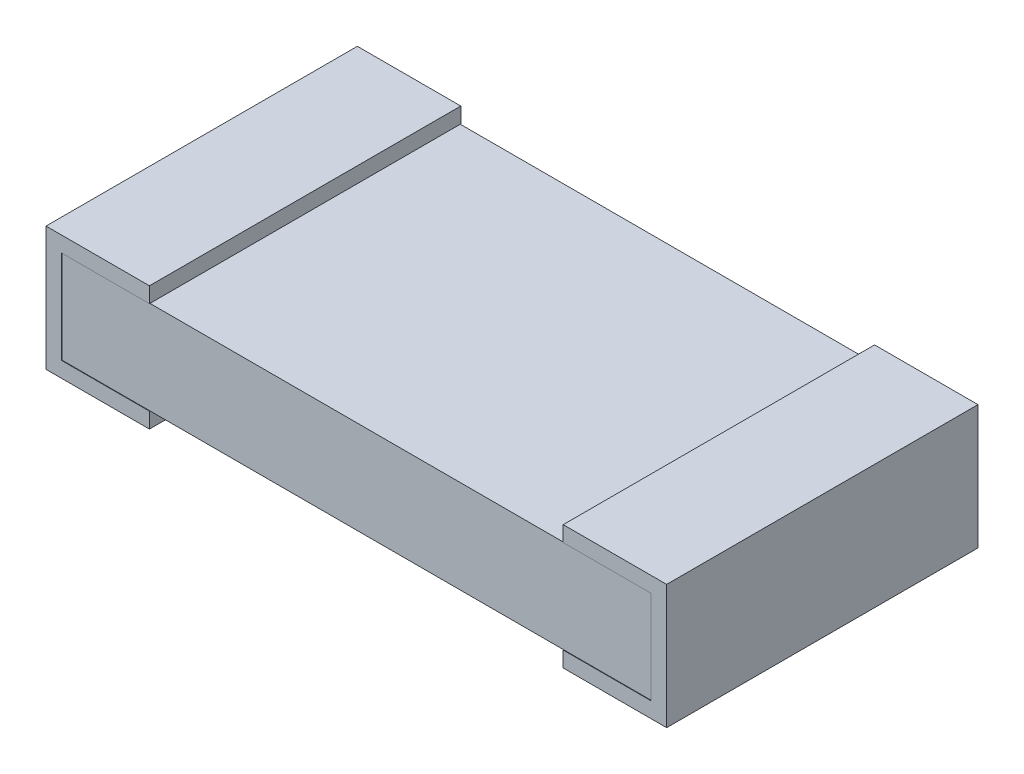
ISO-10303-21;
HEADER;
FILE_DESCRIPTION(('STEP AP214'),'2;1');
FILE_NAME('part.step','',(''),(''),'','','');
FILE_SCHEMA(('AUTOMOTIVE_DESIGN { 1 0 10303 214 1 1 1 1 }'));
ENDSEC;
DATA;
#1=APPLICATION_CONTEXT('core data for automotive mechanical design processes');
#2=APPLICATION_PROTOCOL_DEFINITION('international standard','automotive_design',2000,#1);
#3=PRODUCT_CONTEXT('',#1,'mechanical');
#4=PRODUCT('Part','Part','',(#3));
#5=PRODUCT_RELATED_PRODUCT_CATEGORY('part','',(#4));
#6=PRODUCT_DEFINITION_FORMATION('','',#4);
#7=PRODUCT_DEFINITION_CONTEXT('part definition',#1,'design');
#8=PRODUCT_DEFINITION('design','',#6,#7);
#9=PRODUCT_DEFINITION_SHAPE('','',#8);
#10=(LENGTH_UNIT() NAMED_UNIT(*) SI_UNIT(.MILLI.,.METRE.));
#11=(NAMED_UNIT(*) PLANE_ANGLE_UNIT() SI_UNIT($,.RADIAN.));
#12=(NAMED_UNIT(*) SI_UNIT($,.STERADIAN.) SOLID_ANGLE_UNIT());
#13=UNCERTAINTY_MEASURE_WITH_UNIT(LENGTH_MEASURE(1.E-05),#10,'distance_accuracy_value','');
#14=(GEOMETRIC_REPRESENTATION_CONTEXT(3) GLOBAL_UNCERTAINTY_ASSIGNED_CONTEXT((#13)) GLOBAL_UNIT_ASSIGNED_CONTEXT((#10,
#11,#12)) REPRESENTATION_CONTEXT('',''));
#15=CARTESIAN_POINT('',(0.,0.,0.));
#16=DIRECTION('',(0.,0.,1.));
#17=DIRECTION('',(1.,0.,0.));
#18=AXIS2_PLACEMENT_3D('',#15,#16,#17);
#19=CARTESIAN_POINT('',(2.9718,0.0762000000000004,-0.762));
#20=DIRECTION('',(0.,-1.,0.));
#21=DIRECTION('',(1.,0.,0.));
#22=AXIS2_PLACEMENT_3D('',#19,#20,#21);
#23=PLANE('',#22);
#24=DIRECTION('',(1.,0.,0.));
#25=VECTOR('',#24,1.);
#26=CARTESIAN_POINT('',(2.9718,0.0762000000000004,-0.762));
#27=LINE('',#26,#25);
#28=CARTESIAN_POINT('',(0.508,0.0762000000000001,-0.762));
#29=VERTEX_POINT('',#28);
#30=CARTESIAN_POINT('',(2.54,0.0762000000000001,-0.762));
#31=VERTEX_POINT('',#30);
#32=EDGE_CURVE('E43',#29,#31,#27,.T.);
#33=ORIENTED_EDGE('',*,*,#32,.T.);
#34=DIRECTION('',(0.,0.,-1.));
#35=VECTOR('',#34,1.);
#36=CARTESIAN_POINT('',(2.54,0.0762000000000001,0.76454));
#37=LINE('',#36,#35);
#38=CARTESIAN_POINT('',(2.54,0.0762000000000001,0.762));
#39=VERTEX_POINT('',#38);
#40=EDGE_CURVE('E274',#39,#31,#37,.T.);
#41=ORIENTED_EDGE('',*,*,#40,.F.);
#42=DIRECTION('',(1.,0.,0.));
#43=VECTOR('',#42,1.);
#44=CARTESIAN_POINT('',(2.9718,0.0762000000000004,0.762));
#45=LINE('',#44,#43);
#46=CARTESIAN_POINT('',(0.508,0.0762000000000001,0.762));
#47=VERTEX_POINT('',#46);
#48=EDGE_CURVE('E373',#47,#39,#45,.T.);
#49=ORIENTED_EDGE('',*,*,#48,.F.);
#50=DIRECTION('',(0.,0.,-1.));
#51=VECTOR('',#50,1.);
#52=CARTESIAN_POINT('',(0.508,0.0762000000000001,0.76454));
#53=LINE('',#52,#51);
#54=EDGE_CURVE('E335',#47,#29,#53,.T.);
#55=ORIENTED_EDGE('',*,*,#54,.T.);
#56=EDGE_LOOP('',(#33,#41,#49,#55));
#57=FACE_BOUND('',#56,.T.);
#58=ADVANCED_FACE('F34',(#57),#23,.T.);
#59=CARTESIAN_POINT('',(0.0762,0.5334,-0.762));
#60=DIRECTION('',(0.,1.,0.));
#61=DIRECTION('',(0.,0.,1.));
#62=AXIS2_PLACEMENT_3D('',#59,#60,#61);
#63=PLANE('',#62);
#64=DIRECTION('',(-1.,0.,0.));
#65=VECTOR('',#64,1.);
#66=CARTESIAN_POINT('',(0.0762,0.5334,0.762));
#67=LINE('',#66,#65);
#68=CARTESIAN_POINT('',(2.54,0.5334,0.762));
#69=VERTEX_POINT('',#68);
#70=CARTESIAN_POINT('',(0.508,0.5334,0.762));
#71=VERTEX_POINT('',#70);
#72=EDGE_CURVE('E366',#69,#71,#67,.T.);
#73=ORIENTED_EDGE('',*,*,#72,.F.);
#74=DIRECTION('',(0.,0.,-1.));
#75=VECTOR('',#74,1.);
#76=CARTESIAN_POINT('',(2.54,0.5334,0.76454));
#77=LINE('',#76,#75);
#78=CARTESIAN_POINT('',(2.54,0.5334,-0.762));
#79=VERTEX_POINT('',#78);
#80=EDGE_CURVE('E263',#69,#79,#77,.T.);
#81=ORIENTED_EDGE('',*,*,#80,.T.);
#82=DIRECTION('',(-1.,0.,0.));
#83=VECTOR('',#82,1.);
#84=CARTESIAN_POINT('',(0.0762,0.5334,-0.762));
#85=LINE('',#84,#83);
#86=CARTESIAN_POINT('',(0.508,0.5334,-0.762));
#87=VERTEX_POINT('',#86);
#88=EDGE_CURVE('E355',#79,#87,#85,.T.);
#89=ORIENTED_EDGE('',*,*,#88,.T.);
#90=DIRECTION('',(0.,0.,-1.));
#91=VECTOR('',#90,1.);
#92=CARTESIAN_POINT('',(0.508,0.5334,0.76454));
#93=LINE('',#92,#91);
#94=EDGE_CURVE('E346',#71,#87,#93,.T.);
#95=ORIENTED_EDGE('',*,*,#94,.F.);
#96=EDGE_LOOP('',(#73,#81,#89,#95));
#97=FACE_BOUND('',#96,.T.);
#98=ADVANCED_FACE('F36',(#97),#63,.T.);
#99=CARTESIAN_POINT('',(2.9718,0.5334,-0.762));
#100=DIRECTION('',(0.,0.,-1.));
#101=DIRECTION('',(-1.,0.,0.));
#102=AXIS2_PLACEMENT_3D('',#99,#100,#101);
#103=PLANE('',#102);
#104=DIRECTION('',(0.,1.,0.));
#105=VECTOR('',#104,1.);
#106=CARTESIAN_POINT('',(2.9718,0.0762000000000004,-0.762));
#107=LINE('',#106,#105);
#108=CARTESIAN_POINT('',(2.9718,0.0762,-0.762));
#109=VERTEX_POINT('',#108);
#110=CARTESIAN_POINT('',(2.9718,0.5334,-0.762));
#111=VERTEX_POINT('',#110);
#112=EDGE_CURVE('E353',#109,#111,#107,.T.);
#113=ORIENTED_EDGE('',*,*,#112,.F.);
#114=DIRECTION('',(-1.,0.,0.));
#115=VECTOR('',#114,1.);
#116=CARTESIAN_POINT('',(2.9718,0.0762,-0.762));
#117=LINE('',#116,#115);
#118=EDGE_CURVE('E256',#109,#31,#117,.T.);
#119=ORIENTED_EDGE('',*,*,#118,.T.);
#120=ORIENTED_EDGE('',*,*,#32,.F.);
#121=CARTESIAN_POINT('',(0.0762,0.0762,-0.762));
#122=VERTEX_POINT('',#121);
#123=EDGE_CURVE('E11',#122,#29,#27,.T.);
#124=ORIENTED_EDGE('',*,*,#123,.F.);
#125=DIRECTION('',(0.,-1.,0.));
#126=VECTOR('',#125,1.);
#127=CARTESIAN_POINT('',(0.0762,0.5334,-0.762));
#128=LINE('',#127,#126);
#129=CARTESIAN_POINT('',(0.0762,0.5334,-0.762));
#130=VERTEX_POINT('',#129);
#131=EDGE_CURVE('E358',#130,#122,#128,.T.);
#132=ORIENTED_EDGE('',*,*,#131,.F.);
#133=DIRECTION('',(-1.,0.,0.));
#134=VECTOR('',#133,1.);
#135=CARTESIAN_POINT('',(2.9718,0.5334,-0.762));
#136=LINE('',#135,#134);
#137=EDGE_CURVE('E329',#87,#130,#136,.T.);
#138=ORIENTED_EDGE('',*,*,#137,.F.);
#139=ORIENTED_EDGE('',*,*,#88,.F.);
#140=EDGE_CURVE('E356',#111,#79,#85,.T.);
#141=ORIENTED_EDGE('',*,*,#140,.F.);
#142=EDGE_LOOP('',(#113,#119,#120,#124,#132,#138,#139,#141));
#143=FACE_BOUND('',#142,.T.);
#144=ADVANCED_FACE('F437',(#143),#103,.T.);
#145=CARTESIAN_POINT('',(2.9718,0.5334,0.762));
#146=DIRECTION('',(0.,0.,-1.));
#147=DIRECTION('',(-1.,0.,0.));
#148=AXIS2_PLACEMENT_3D('',#145,#146,#147);
#149=PLANE('',#148);
#150=DIRECTION('',(0.,1.,0.));
#151=VECTOR('',#150,1.);
#152=CARTESIAN_POINT('',(2.9718,0.0762000000000004,0.762));
#153=LINE('',#152,#151);
#154=CARTESIAN_POINT('',(2.9718,0.0762000000000004,0.762));
#155=VERTEX_POINT('',#154);
#156=CARTESIAN_POINT('',(2.9718,0.5334,0.762));
#157=VERTEX_POINT('',#156);
#158=EDGE_CURVE('E352',#155,#157,#153,.T.);
#159=ORIENTED_EDGE('',*,*,#158,.T.);
#160=EDGE_CURVE('E363',#157,#69,#67,.T.);
#161=ORIENTED_EDGE('',*,*,#160,.T.);
#162=ORIENTED_EDGE('',*,*,#72,.T.);
#163=CARTESIAN_POINT('',(0.0762,0.5334,0.762));
#164=VERTEX_POINT('',#163);
#165=EDGE_CURVE('E362',#71,#164,#67,.T.);
#166=ORIENTED_EDGE('',*,*,#165,.T.);
#167=DIRECTION('',(0.,-1.,0.));
#168=VECTOR('',#167,1.);
#169=CARTESIAN_POINT('',(0.0762,0.5334,0.762));
#170=LINE('',#169,#168);
#171=CARTESIAN_POINT('',(0.0762,0.0762,0.762));
#172=VERTEX_POINT('',#171);
#173=EDGE_CURVE('E365',#164,#172,#170,.T.);
#174=ORIENTED_EDGE('',*,*,#173,.T.);
#175=EDGE_CURVE('E38',#172,#47,#45,.T.);
#176=ORIENTED_EDGE('',*,*,#175,.T.);
#177=ORIENTED_EDGE('',*,*,#48,.T.);
#178=EDGE_CURVE('E368',#39,#155,#45,.T.);
#179=ORIENTED_EDGE('',*,*,#178,.T.);
#180=EDGE_LOOP('',(#159,#161,#162,#166,#174,#176,#177,#179));
#181=FACE_BOUND('',#180,.T.);
#182=ADVANCED_FACE('F375',(#181),#149,.F.);
#183=CARTESIAN_POINT('',(0.0762,0.0762,0.76454));
#184=DIRECTION('',(0.,1.,0.));
#185=DIRECTION('',(-1.,0.,0.));
#186=AXIS2_PLACEMENT_3D('',#183,#184,#185);
#187=PLANE('',#186);
#188=ORIENTED_EDGE('',*,*,#175,.F.);
#189=DIRECTION('',(0.,0.,-1.));
#190=VECTOR('',#189,1.);
#191=CARTESIAN_POINT('',(0.0762,0.0762,0.76454));
#192=LINE('',#191,#190);
#193=CARTESIAN_POINT('',(0.0762,0.0762,0.76454));
#194=VERTEX_POINT('',#193);
#195=EDGE_CURVE('E337',#194,#172,#192,.T.);
#196=ORIENTED_EDGE('',*,*,#195,.F.);
#197=DIRECTION('',(1.,0.,0.));
#198=VECTOR('',#197,1.);
#199=CARTESIAN_POINT('',(0.0762,0.0762,0.76454));
#200=LINE('',#199,#198);
#201=CARTESIAN_POINT('',(0.508,0.0762000000000001,0.76454));
#202=VERTEX_POINT('',#201);
#203=EDGE_CURVE('E295',#194,#202,#200,.T.);
#204=ORIENTED_EDGE('',*,*,#203,.T.);
#205=EDGE_CURVE('E332',#202,#47,#53,.T.);
#206=ORIENTED_EDGE('',*,*,#205,.T.);
#207=EDGE_LOOP('',(#188,#196,#204,#206));
#208=FACE_BOUND('',#207,.T.);
#209=ADVANCED_FACE('F378',(#208),#187,.T.);
#210=CARTESIAN_POINT('',(0.0762,0.5334,0.76454));
#211=DIRECTION('',(1.,0.,0.));
#212=DIRECTION('',(0.,0.,-1.));
#213=AXIS2_PLACEMENT_3D('',#210,#211,#212);
#214=PLANE('',#213);
#215=ORIENTED_EDGE('',*,*,#173,.F.);
#216=DIRECTION('',(0.,0.,-1.));
#217=VECTOR('',#216,1.);
#218=CARTESIAN_POINT('',(0.0762,0.5334,0.76454));
#219=LINE('',#218,#217);
#220=CARTESIAN_POINT('',(0.0762,0.5334,0.76454));
#221=VERTEX_POINT('',#220);
#222=EDGE_CURVE('E59',#221,#164,#219,.T.);
#223=ORIENTED_EDGE('',*,*,#222,.F.);
#224=DIRECTION('',(0.,-1.,0.));
#225=VECTOR('',#224,1.);
#226=CARTESIAN_POINT('',(0.0762,0.5334,0.76454));
#227=LINE('',#226,#225);
#228=EDGE_CURVE('E292',#221,#194,#227,.T.);
#229=ORIENTED_EDGE('',*,*,#228,.T.);
#230=ORIENTED_EDGE('',*,*,#195,.T.);
#231=EDGE_LOOP('',(#215,#223,#229,#230));
#232=FACE_BOUND('',#231,.T.);
#233=ADVANCED_FACE('F381',(#232),#214,.T.);
#234=CARTESIAN_POINT('',(0.508,0.5334,0.76454));
#235=DIRECTION('',(0.,-1.,0.));
#236=DIRECTION('',(0.,0.,-1.));
#237=AXIS2_PLACEMENT_3D('',#234,#235,#236);
#238=PLANE('',#237);
#239=ORIENTED_EDGE('',*,*,#165,.F.);
#240=CARTESIAN_POINT('',(0.508,0.5334,0.76454));
#241=VERTEX_POINT('',#240);
#242=EDGE_CURVE('E343',#241,#71,#93,.T.);
#243=ORIENTED_EDGE('',*,*,#242,.F.);
#244=DIRECTION('',(-1.,0.,0.));
#245=VECTOR('',#244,1.);
#246=CARTESIAN_POINT('',(0.508,0.5334,0.76454));
#247=LINE('',#246,#245);
#248=EDGE_CURVE('E290',#241,#221,#247,.T.);
#249=ORIENTED_EDGE('',*,*,#248,.T.);
#250=ORIENTED_EDGE('',*,*,#222,.T.);
#251=EDGE_LOOP('',(#239,#243,#249,#250));
#252=FACE_BOUND('',#251,.T.);
#253=ADVANCED_FACE('F389',(#252),#238,.T.);
#254=CARTESIAN_POINT('',(0.,0.,0.76454));
#255=DIRECTION('',(-1.,0.,0.));
#256=DIRECTION('',(0.,0.,1.));
#257=AXIS2_PLACEMENT_3D('',#254,#255,#256);
#258=PLANE('',#257);
#259=DIRECTION('',(0.,1.,0.));
#260=VECTOR('',#259,1.);
#261=CARTESIAN_POINT('',(0.,0.,-0.76454));
#262=LINE('',#261,#260);
#263=CARTESIAN_POINT('',(0.,0.,-0.76454));
#264=VERTEX_POINT('',#263);
#265=CARTESIAN_POINT('',(0.,0.6096,-0.76454));
#266=VERTEX_POINT('',#265);
#267=EDGE_CURVE('E279',#264,#266,#262,.T.);
#268=ORIENTED_EDGE('',*,*,#267,.F.);
#269=DIRECTION('',(0.,0.,-1.));
#270=VECTOR('',#269,1.);
#271=CARTESIAN_POINT('',(0.,0.,0.76454));
#272=LINE('',#271,#270);
#273=CARTESIAN_POINT('',(0.,0.,0.76454));
#274=VERTEX_POINT('',#273);
#275=EDGE_CURVE('E327',#274,#264,#272,.T.);
#276=ORIENTED_EDGE('',*,*,#275,.F.);
#277=DIRECTION('',(0.,1.,0.));
#278=VECTOR('',#277,1.);
#279=CARTESIAN_POINT('',(0.,0.,0.76454));
#280=LINE('',#279,#278);
#281=CARTESIAN_POINT('',(0.,0.6096,0.76454));
#282=VERTEX_POINT('',#281);
#283=EDGE_CURVE('E280',#274,#282,#280,.T.);
#284=ORIENTED_EDGE('',*,*,#283,.T.);
#285=DIRECTION('',(0.,0.,-1.));
#286=VECTOR('',#285,1.);
#287=CARTESIAN_POINT('',(0.,0.6096,0.76454));
#288=LINE('',#287,#286);
#289=EDGE_CURVE('E304',#282,#266,#288,.T.);
#290=ORIENTED_EDGE('',*,*,#289,.T.);
#291=EDGE_LOOP('',(#268,#276,#284,#290));
#292=FACE_BOUND('',#291,.T.);
#293=ADVANCED_FACE('F415',(#292),#258,.T.);
#294=CARTESIAN_POINT('',(0.,0.,0.76454));
#295=DIRECTION('',(0.,-1.,0.));
#296=DIRECTION('',(1.,0.,0.));
#297=AXIS2_PLACEMENT_3D('',#294,#295,#296);
#298=PLANE('',#297);
#299=DIRECTION('',(-1.,0.,0.));
#300=VECTOR('',#299,1.);
#301=CARTESIAN_POINT('',(0.,0.,-0.76454));
#302=LINE('',#301,#300);
#303=CARTESIAN_POINT('',(0.508,0.,-0.76454));
#304=VERTEX_POINT('',#303);
#305=EDGE_CURVE('E284',#304,#264,#302,.T.);
#306=ORIENTED_EDGE('',*,*,#305,.F.);
#307=DIRECTION('',(0.,0.,-1.));
#308=VECTOR('',#307,1.);
#309=CARTESIAN_POINT('',(0.508,0.,0.76454));
#310=LINE('',#309,#308);
#311=CARTESIAN_POINT('',(0.508,0.,0.76454));
#312=VERTEX_POINT('',#311);
#313=EDGE_CURVE('E330',#312,#304,#310,.T.);
#314=ORIENTED_EDGE('',*,*,#313,.F.);
#315=DIRECTION('',(-1.,0.,0.));
#316=VECTOR('',#315,1.);
#317=CARTESIAN_POINT('',(0.,0.,0.76454));
#318=LINE('',#317,#316);
#319=EDGE_CURVE('E301',#312,#274,#318,.T.);
#320=ORIENTED_EDGE('',*,*,#319,.T.);
#321=ORIENTED_EDGE('',*,*,#275,.T.);
#322=EDGE_LOOP('',(#306,#314,#320,#321));
#323=FACE_BOUND('',#322,.T.);
#324=ADVANCED_FACE('F418',(#323),#298,.T.);
#325=CARTESIAN_POINT('',(0.508,0.,0.76454));
#326=DIRECTION('',(1.,0.,0.));
#327=DIRECTION('',(0.,0.,-1.));
#328=AXIS2_PLACEMENT_3D('',#325,#326,#327);
#329=PLANE('',#328);
#330=DIRECTION('',(0.,-1.,0.));
#331=VECTOR('',#330,1.);
#332=CARTESIAN_POINT('',(0.508,0.,-0.76454));
#333=LINE('',#332,#331);
#334=CARTESIAN_POINT('',(0.508,0.0762000000000001,-0.76454));
#335=VERTEX_POINT('',#334);
#336=EDGE_CURVE('E322',#335,#304,#333,.T.);
#337=ORIENTED_EDGE('',*,*,#336,.F.);
#338=EDGE_CURVE('E336',#29,#335,#53,.T.);
#339=ORIENTED_EDGE('',*,*,#338,.F.);
#340=ORIENTED_EDGE('',*,*,#54,.F.);
#341=ORIENTED_EDGE('',*,*,#205,.F.);
#342=DIRECTION('',(0.,-1.,0.));
#343=VECTOR('',#342,1.);
#344=CARTESIAN_POINT('',(0.508,0.,0.76454));
#345=LINE('',#344,#343);
#346=EDGE_CURVE('E298',#202,#312,#345,.T.);
#347=ORIENTED_EDGE('',*,*,#346,.T.);
#348=ORIENTED_EDGE('',*,*,#313,.T.);
#349=EDGE_LOOP('',(#337,#339,#340,#341,#347,#348));
#350=FACE_BOUND('',#349,.T.);
#351=ADVANCED_FACE('F421',(#350),#329,.T.);
#352=CARTESIAN_POINT('',(0.0762,0.0762,-0.76454));
#353=VERTEX_POINT('',#352);
#354=EDGE_CURVE('E340',#122,#353,#192,.T.);
#355=ORIENTED_EDGE('',*,*,#354,.F.);
#356=ORIENTED_EDGE('',*,*,#123,.T.);
#357=ORIENTED_EDGE('',*,*,#338,.T.);
#358=DIRECTION('',(1.,0.,0.));
#359=VECTOR('',#358,1.);
#360=CARTESIAN_POINT('',(0.0762,0.0762,-0.76454));
#361=LINE('',#360,#359);
#362=EDGE_CURVE('E319',#353,#335,#361,.T.);
#363=ORIENTED_EDGE('',*,*,#362,.F.);
#364=EDGE_LOOP('',(#355,#356,#357,#363));
#365=FACE_BOUND('',#364,.T.);
#366=ADVANCED_FACE('F430',(#365),#187,.T.);
#367=CARTESIAN_POINT('',(0.0762,0.5334,-0.76454));
#368=VERTEX_POINT('',#367);
#369=EDGE_CURVE('E342',#130,#368,#219,.T.);
#370=ORIENTED_EDGE('',*,*,#369,.F.);
#371=ORIENTED_EDGE('',*,*,#131,.T.);
#372=ORIENTED_EDGE('',*,*,#354,.T.);
#373=DIRECTION('',(0.,-1.,0.));
#374=VECTOR('',#373,1.);
#375=CARTESIAN_POINT('',(0.0762,0.5334,-0.76454));
#376=LINE('',#375,#374);
#377=EDGE_CURVE('E316',#368,#353,#376,.T.);
#378=ORIENTED_EDGE('',*,*,#377,.F.);
#379=EDGE_LOOP('',(#370,#371,#372,#378));
#380=FACE_BOUND('',#379,.T.);
#381=ADVANCED_FACE('F433',(#380),#214,.T.);
#382=CARTESIAN_POINT('',(0.508,0.5334,-0.76454));
#383=VERTEX_POINT('',#382);
#384=EDGE_CURVE('E347',#87,#383,#93,.T.);
#385=ORIENTED_EDGE('',*,*,#384,.F.);
#386=ORIENTED_EDGE('',*,*,#137,.T.);
#387=ORIENTED_EDGE('',*,*,#369,.T.);
#388=DIRECTION('',(-1.,0.,0.));
#389=VECTOR('',#388,1.);
#390=CARTESIAN_POINT('',(0.508,0.5334,-0.76454));
#391=LINE('',#390,#389);
#392=EDGE_CURVE('E313',#383,#368,#391,.T.);
#393=ORIENTED_EDGE('',*,*,#392,.F.);
#394=EDGE_LOOP('',(#385,#386,#387,#393));
#395=FACE_BOUND('',#394,.T.);
#396=ADVANCED_FACE('F403',(#395),#238,.T.);
#397=CARTESIAN_POINT('',(0.508,0.6096,0.76454));
#398=DIRECTION('',(1.,0.,0.));
#399=DIRECTION('',(0.,1.,0.));
#400=AXIS2_PLACEMENT_3D('',#397,#398,#399);
#401=PLANE('',#400);
#402=DIRECTION('',(0.,-1.,0.));
#403=VECTOR('',#402,1.);
#404=CARTESIAN_POINT('',(0.508,0.6096,-0.76454));
#405=LINE('',#404,#403);
#406=CARTESIAN_POINT('',(0.508,0.6096,-0.76454));
#407=VERTEX_POINT('',#406);
#408=EDGE_CURVE('E310',#407,#383,#405,.T.);
#409=ORIENTED_EDGE('',*,*,#408,.F.);
#410=DIRECTION('',(0.,0.,-1.));
#411=VECTOR('',#410,1.);
#412=CARTESIAN_POINT('',(0.508,0.6096,0.76454));
#413=LINE('',#412,#411);
#414=CARTESIAN_POINT('',(0.508,0.6096,0.76454));
#415=VERTEX_POINT('',#414);
#416=EDGE_CURVE('E348',#415,#407,#413,.T.);
#417=ORIENTED_EDGE('',*,*,#416,.F.);
#418=DIRECTION('',(0.,-1.,0.));
#419=VECTOR('',#418,1.);
#420=CARTESIAN_POINT('',(0.508,0.6096,0.76454));
#421=LINE('',#420,#419);
#422=EDGE_CURVE('E287',#415,#241,#421,.T.);
#423=ORIENTED_EDGE('',*,*,#422,.T.);
#424=ORIENTED_EDGE('',*,*,#242,.T.);
#425=ORIENTED_EDGE('',*,*,#94,.T.);
#426=ORIENTED_EDGE('',*,*,#384,.T.);
#427=EDGE_LOOP('',(#409,#417,#423,#424,#425,#426));
#428=FACE_BOUND('',#427,.T.);
#429=ADVANCED_FACE('F394',(#428),#401,.T.);
#430=CARTESIAN_POINT('',(0.,0.6096,0.76454));
#431=DIRECTION('',(0.,1.,0.));
#432=DIRECTION('',(0.,0.,1.));
#433=AXIS2_PLACEMENT_3D('',#430,#431,#432);
#434=PLANE('',#433);
#435=DIRECTION('',(1.,0.,0.));
#436=VECTOR('',#435,1.);
#437=CARTESIAN_POINT('',(0.,0.6096,-0.76454));
#438=LINE('',#437,#436);
#439=EDGE_CURVE('E307',#266,#407,#438,.T.);
#440=ORIENTED_EDGE('',*,*,#439,.F.);
#441=ORIENTED_EDGE('',*,*,#289,.F.);
#442=DIRECTION('',(1.,0.,0.));
#443=VECTOR('',#442,1.);
#444=CARTESIAN_POINT('',(0.,0.6096,0.76454));
#445=LINE('',#444,#443);
#446=EDGE_CURVE('E283',#282,#415,#445,.T.);
#447=ORIENTED_EDGE('',*,*,#446,.T.);
#448=ORIENTED_EDGE('',*,*,#416,.T.);
#449=EDGE_LOOP('',(#440,#441,#447,#448));
#450=FACE_BOUND('',#449,.T.);
#451=ADVANCED_FACE('F411',(#450),#434,.T.);
#452=CARTESIAN_POINT('',(0.,0.6096,0.76454));
#453=DIRECTION('',(0.,0.,-1.));
#454=DIRECTION('',(-1.,0.,0.));
#455=AXIS2_PLACEMENT_3D('',#452,#453,#454);
#456=PLANE('',#455);
#457=ORIENTED_EDGE('',*,*,#283,.F.);
#458=ORIENTED_EDGE('',*,*,#319,.F.);
#459=ORIENTED_EDGE('',*,*,#346,.F.);
#460=ORIENTED_EDGE('',*,*,#203,.F.);
#461=ORIENTED_EDGE('',*,*,#228,.F.);
#462=ORIENTED_EDGE('',*,*,#248,.F.);
#463=ORIENTED_EDGE('',*,*,#422,.F.);
#464=ORIENTED_EDGE('',*,*,#446,.F.);
#465=EDGE_LOOP('',(#457,#458,#459,#460,#461,#462,#463,#464));
#466=FACE_BOUND('',#465,.T.);
#467=ADVANCED_FACE('F386',(#466),#456,.F.);
#468=CARTESIAN_POINT('',(0.,0.6096,-0.76454));
#469=DIRECTION('',(0.,0.,-1.));
#470=DIRECTION('',(-1.,0.,0.));
#471=AXIS2_PLACEMENT_3D('',#468,#469,#470);
#472=PLANE('',#471);
#473=ORIENTED_EDGE('',*,*,#267,.T.);
#474=ORIENTED_EDGE('',*,*,#439,.T.);
#475=ORIENTED_EDGE('',*,*,#408,.T.);
#476=ORIENTED_EDGE('',*,*,#392,.T.);
#477=ORIENTED_EDGE('',*,*,#377,.T.);
#478=ORIENTED_EDGE('',*,*,#362,.T.);
#479=ORIENTED_EDGE('',*,*,#336,.T.);
#480=ORIENTED_EDGE('',*,*,#305,.T.);
#481=EDGE_LOOP('',(#473,#474,#475,#476,#477,#478,#479,#480));
#482=FACE_BOUND('',#481,.T.);
#483=ADVANCED_FACE('F407',(#482),#472,.T.);
#484=CARTESIAN_POINT('',(2.54,0.5334,0.76454));
#485=DIRECTION('',(0.,1.,0.));
#486=DIRECTION('',(0.,0.,1.));
#487=AXIS2_PLACEMENT_3D('',#484,#485,#486);
#488=PLANE('',#487);
#489=CARTESIAN_POINT('',(2.54,0.5334,0.76454));
#490=VERTEX_POINT('',#489);
#491=EDGE_CURVE('E260',#490,#69,#77,.T.);
#492=ORIENTED_EDGE('',*,*,#491,.T.);
#493=ORIENTED_EDGE('',*,*,#160,.F.);
#494=DIRECTION('',(0.,0.,-1.));
#495=VECTOR('',#494,1.);
#496=CARTESIAN_POINT('',(2.9718,0.5334,0.76454));
#497=LINE('',#496,#495);
#498=CARTESIAN_POINT('',(2.9718,0.5334,0.76454));
#499=VERTEX_POINT('',#498);
#500=EDGE_CURVE('E265',#499,#157,#497,.T.);
#501=ORIENTED_EDGE('',*,*,#500,.F.);
#502=DIRECTION('',(1.,0.,0.));
#503=VECTOR('',#502,1.);
#504=CARTESIAN_POINT('',(2.54,0.5334,0.76454));
#505=LINE('',#504,#503);
#506=EDGE_CURVE('E234',#490,#499,#505,.T.);
#507=ORIENTED_EDGE('',*,*,#506,.F.);
#508=EDGE_LOOP('',(#492,#493,#501,#507));
#509=FACE_BOUND('',#508,.T.);
#510=ADVANCED_FACE('F463',(#509),#488,.F.);
#511=CARTESIAN_POINT('',(2.9718,0.5334,0.76454));
#512=DIRECTION('',(1.,0.,0.));
#513=DIRECTION('',(0.,0.,-1.));
#514=AXIS2_PLACEMENT_3D('',#511,#512,#513);
#515=PLANE('',#514);
#516=ORIENTED_EDGE('',*,*,#500,.T.);
#517=ORIENTED_EDGE('',*,*,#158,.F.);
#518=DIRECTION('',(0.,0.,-1.));
#519=VECTOR('',#518,1.);
#520=CARTESIAN_POINT('',(2.9718,0.0762,0.76454));
#521=LINE('',#520,#519);
#522=CARTESIAN_POINT('',(2.9718,0.0762,0.76454));
#523=VERTEX_POINT('',#522);
#524=EDGE_CURVE('E51',#523,#155,#521,.T.);
#525=ORIENTED_EDGE('',*,*,#524,.F.);
#526=DIRECTION('',(0.,-1.,0.));
#527=VECTOR('',#526,1.);
#528=CARTESIAN_POINT('',(2.9718,0.5334,0.76454));
#529=LINE('',#528,#527);
#530=EDGE_CURVE('E232',#499,#523,#529,.T.);
#531=ORIENTED_EDGE('',*,*,#530,.F.);
#532=EDGE_LOOP('',(#516,#517,#525,#531));
#533=FACE_BOUND('',#532,.T.);
#534=ADVANCED_FACE('F466',(#533),#515,.F.);
#535=CARTESIAN_POINT('',(2.9718,0.0762,0.76454));
#536=DIRECTION('',(0.,-1.,0.));
#537=DIRECTION('',(1.,0.,0.));
#538=AXIS2_PLACEMENT_3D('',#535,#536,#537);
#539=PLANE('',#538);
#540=ORIENTED_EDGE('',*,*,#524,.T.);
#541=ORIENTED_EDGE('',*,*,#178,.F.);
#542=CARTESIAN_POINT('',(2.54,0.0762000000000001,0.76454));
#543=VERTEX_POINT('',#542);
#544=EDGE_CURVE('E271',#543,#39,#37,.T.);
#545=ORIENTED_EDGE('',*,*,#544,.F.);
#546=DIRECTION('',(-1.,0.,0.));
#547=VECTOR('',#546,1.);
#548=CARTESIAN_POINT('',(2.9718,0.0762,0.76454));
#549=LINE('',#548,#547);
#550=EDGE_CURVE('E230',#523,#543,#549,.T.);
#551=ORIENTED_EDGE('',*,*,#550,.F.);
#552=EDGE_LOOP('',(#540,#541,#545,#551));
#553=FACE_BOUND('',#552,.T.);
#554=ADVANCED_FACE('F468',(#553),#539,.F.);
#555=CARTESIAN_POINT('',(3.048,0.,0.76454));
#556=DIRECTION('',(-1.,0.,0.));
#557=DIRECTION('',(0.,0.,1.));
#558=AXIS2_PLACEMENT_3D('',#555,#556,#557);
#559=PLANE('',#558);
#560=DIRECTION('',(0.,1.,0.));
#561=VECTOR('',#560,1.);
#562=CARTESIAN_POINT('',(3.048,0.,-0.76454));
#563=LINE('',#562,#561);
#564=CARTESIAN_POINT('',(3.048,0.,-0.76454));
#565=VERTEX_POINT('',#564);
#566=CARTESIAN_POINT('',(3.048,0.6096,-0.76454));
#567=VERTEX_POINT('',#566);
#568=EDGE_CURVE('E239',#565,#567,#563,.T.);
#569=ORIENTED_EDGE('',*,*,#568,.T.);
#570=DIRECTION('',(0.,0.,-1.));
#571=VECTOR('',#570,1.);
#572=CARTESIAN_POINT('',(3.048,0.6096,0.76454));
#573=LINE('',#572,#571);
#574=CARTESIAN_POINT('',(3.048,0.6096,0.76454));
#575=VERTEX_POINT('',#574);
#576=EDGE_CURVE('E223',#575,#567,#573,.T.);
#577=ORIENTED_EDGE('',*,*,#576,.F.);
#578=DIRECTION('',(0.,1.,0.));
#579=VECTOR('',#578,1.);
#580=CARTESIAN_POINT('',(3.048,0.,0.76454));
#581=LINE('',#580,#579);
#582=CARTESIAN_POINT('',(3.048,0.,0.76454));
#583=VERTEX_POINT('',#582);
#584=EDGE_CURVE('E202',#583,#575,#581,.T.);
#585=ORIENTED_EDGE('',*,*,#584,.F.);
#586=DIRECTION('',(0.,0.,-1.));
#587=VECTOR('',#586,1.);
#588=CARTESIAN_POINT('',(3.048,0.,0.76454));
#589=LINE('',#588,#587);
#590=EDGE_CURVE('E211',#583,#565,#589,.T.);
#591=ORIENTED_EDGE('',*,*,#590,.T.);
#592=EDGE_LOOP('',(#569,#577,#585,#591));
#593=FACE_BOUND('',#592,.T.);
#594=ADVANCED_FACE('F221',(#593),#559,.F.);
#595=CARTESIAN_POINT('',(3.048,0.6096,0.76454));
#596=DIRECTION('',(0.,-1.,0.));
#597=DIRECTION('',(0.,0.,-1.));
#598=AXIS2_PLACEMENT_3D('',#595,#596,#597);
#599=PLANE('',#598);
#600=DIRECTION('',(-1.,0.,0.));
#601=VECTOR('',#600,1.);
#602=CARTESIAN_POINT('',(3.048,0.6096,-0.76454));
#603=LINE('',#602,#601);
#604=CARTESIAN_POINT('',(2.54,0.6096,-0.76454));
#605=VERTEX_POINT('',#604);
#606=EDGE_CURVE('E224',#567,#605,#603,.T.);
#607=ORIENTED_EDGE('',*,*,#606,.T.);
#608=DIRECTION('',(0.,0.,-1.));
#609=VECTOR('',#608,1.);
#610=CARTESIAN_POINT('',(2.54,0.6096,0.76454));
#611=LINE('',#610,#609);
#612=CARTESIAN_POINT('',(2.54,0.6096,0.76454));
#613=VERTEX_POINT('',#612);
#614=EDGE_CURVE('E257',#613,#605,#611,.T.);
#615=ORIENTED_EDGE('',*,*,#614,.F.);
#616=DIRECTION('',(-1.,0.,0.));
#617=VECTOR('',#616,1.);
#618=CARTESIAN_POINT('',(3.048,0.6096,0.76454));
#619=LINE('',#618,#617);
#620=EDGE_CURVE('E219',#575,#613,#619,.T.);
#621=ORIENTED_EDGE('',*,*,#620,.F.);
#622=ORIENTED_EDGE('',*,*,#576,.T.);
#623=EDGE_LOOP('',(#607,#615,#621,#622));
#624=FACE_BOUND('',#623,.T.);
#625=ADVANCED_FACE('F454',(#624),#599,.F.);
#626=CARTESIAN_POINT('',(2.54,0.6096,0.76454));
#627=DIRECTION('',(1.,0.,0.));
#628=DIRECTION('',(0.,1.,0.));
#629=AXIS2_PLACEMENT_3D('',#626,#627,#628);
#630=PLANE('',#629);
#631=DIRECTION('',(0.,-1.,0.));
#632=VECTOR('',#631,1.);
#633=CARTESIAN_POINT('',(2.54,0.6096,-0.76454));
#634=LINE('',#633,#632);
#635=CARTESIAN_POINT('',(2.54,0.5334,-0.76454));
#636=VERTEX_POINT('',#635);
#637=EDGE_CURVE('E226',#605,#636,#634,.T.);
#638=ORIENTED_EDGE('',*,*,#637,.T.);
#639=EDGE_CURVE('E264',#79,#636,#77,.T.);
#640=ORIENTED_EDGE('',*,*,#639,.F.);
#641=ORIENTED_EDGE('',*,*,#80,.F.);
#642=ORIENTED_EDGE('',*,*,#491,.F.);
#643=DIRECTION('',(0.,-1.,0.));
#644=VECTOR('',#643,1.);
#645=CARTESIAN_POINT('',(2.54,0.6096,0.76454));
#646=LINE('',#645,#644);
#647=EDGE_CURVE('E236',#613,#490,#646,.T.);
#648=ORIENTED_EDGE('',*,*,#647,.F.);
#649=ORIENTED_EDGE('',*,*,#614,.T.);
#650=EDGE_LOOP('',(#638,#640,#641,#642,#648,#649));
#651=FACE_BOUND('',#650,.T.);
#652=ADVANCED_FACE('F460',(#651),#630,.F.);
#653=ORIENTED_EDGE('',*,*,#140,.T.);
#654=ORIENTED_EDGE('',*,*,#639,.T.);
#655=DIRECTION('',(1.,0.,0.));
#656=VECTOR('',#655,1.);
#657=CARTESIAN_POINT('',(2.54,0.5334,-0.76454));
#658=LINE('',#657,#656);
#659=CARTESIAN_POINT('',(2.9718,0.5334,-0.76454));
#660=VERTEX_POINT('',#659);
#661=EDGE_CURVE('E250',#636,#660,#658,.T.);
#662=ORIENTED_EDGE('',*,*,#661,.T.);
#663=EDGE_CURVE('E268',#111,#660,#497,.T.);
#664=ORIENTED_EDGE('',*,*,#663,.F.);
#665=EDGE_LOOP('',(#653,#654,#662,#664));
#666=FACE_BOUND('',#665,.T.);
#667=ADVANCED_FACE('F551',(#666),#488,.F.);
#668=ORIENTED_EDGE('',*,*,#112,.T.);
#669=ORIENTED_EDGE('',*,*,#663,.T.);
#670=DIRECTION('',(0.,-1.,0.));
#671=VECTOR('',#670,1.);
#672=CARTESIAN_POINT('',(2.9718,0.5334,-0.76454));
#673=LINE('',#672,#671);
#674=CARTESIAN_POINT('',(2.9718,0.0762,-0.76454));
#675=VERTEX_POINT('',#674);
#676=EDGE_CURVE('E247',#660,#675,#673,.T.);
#677=ORIENTED_EDGE('',*,*,#676,.T.);
#678=EDGE_CURVE('E270',#109,#675,#521,.T.);
#679=ORIENTED_EDGE('',*,*,#678,.F.);
#680=EDGE_LOOP('',(#668,#669,#677,#679));
#681=FACE_BOUND('',#680,.T.);
#682=ADVANCED_FACE('F477',(#681),#515,.F.);
#683=ORIENTED_EDGE('',*,*,#118,.F.);
#684=ORIENTED_EDGE('',*,*,#678,.T.);
#685=DIRECTION('',(-1.,0.,0.));
#686=VECTOR('',#685,1.);
#687=CARTESIAN_POINT('',(2.9718,0.0762,-0.76454));
#688=LINE('',#687,#686);
#689=CARTESIAN_POINT('',(2.54,0.0762000000000001,-0.76454));
#690=VERTEX_POINT('',#689);
#691=EDGE_CURVE('E244',#675,#690,#688,.T.);
#692=ORIENTED_EDGE('',*,*,#691,.T.);
#693=EDGE_CURVE('E275',#31,#690,#37,.T.);
#694=ORIENTED_EDGE('',*,*,#693,.F.);
#695=EDGE_LOOP('',(#683,#684,#692,#694));
#696=FACE_BOUND('',#695,.T.);
#697=ADVANCED_FACE('F445',(#696),#539,.F.);
#698=CARTESIAN_POINT('',(2.54,0.,0.76454));
#699=DIRECTION('',(1.,0.,0.));
#700=DIRECTION('',(0.,0.,-1.));
#701=AXIS2_PLACEMENT_3D('',#698,#699,#700);
#702=PLANE('',#701);
#703=DIRECTION('',(0.,-1.,0.));
#704=VECTOR('',#703,1.);
#705=CARTESIAN_POINT('',(2.54,0.,-0.76454));
#706=LINE('',#705,#704);
#707=CARTESIAN_POINT('',(2.54,0.,-0.76454));
#708=VERTEX_POINT('',#707);
#709=EDGE_CURVE('E242',#690,#708,#706,.T.);
#710=ORIENTED_EDGE('',*,*,#709,.T.);
#711=DIRECTION('',(0.,0.,-1.));
#712=VECTOR('',#711,1.);
#713=CARTESIAN_POINT('',(2.54,0.,0.76454));
#714=LINE('',#713,#712);
#715=CARTESIAN_POINT('',(2.54,0.,0.76454));
#716=VERTEX_POINT('',#715);
#717=EDGE_CURVE('E218',#716,#708,#714,.T.);
#718=ORIENTED_EDGE('',*,*,#717,.F.);
#719=DIRECTION('',(0.,-1.,0.));
#720=VECTOR('',#719,1.);
#721=CARTESIAN_POINT('',(2.54,0.,0.76454));
#722=LINE('',#721,#720);
#723=EDGE_CURVE('E205',#543,#716,#722,.T.);
#724=ORIENTED_EDGE('',*,*,#723,.F.);
#725=ORIENTED_EDGE('',*,*,#544,.T.);
#726=ORIENTED_EDGE('',*,*,#40,.T.);
#727=ORIENTED_EDGE('',*,*,#693,.T.);
#728=EDGE_LOOP('',(#710,#718,#724,#725,#726,#727));
#729=FACE_BOUND('',#728,.T.);
#730=ADVANCED_FACE('F441',(#729),#702,.F.);
#731=CARTESIAN_POINT('',(3.048,0.,0.76454));
#732=DIRECTION('',(0.,1.,0.));
#733=DIRECTION('',(-1.,0.,0.));
#734=AXIS2_PLACEMENT_3D('',#731,#732,#733);
#735=PLANE('',#734);
#736=DIRECTION('',(1.,0.,0.));
#737=VECTOR('',#736,1.);
#738=CARTESIAN_POINT('',(3.048,0.,-0.76454));
#739=LINE('',#738,#737);
#740=EDGE_CURVE('E214',#708,#565,#739,.T.);
#741=ORIENTED_EDGE('',*,*,#740,.T.);
#742=ORIENTED_EDGE('',*,*,#590,.F.);
#743=DIRECTION('',(1.,0.,0.));
#744=VECTOR('',#743,1.);
#745=CARTESIAN_POINT('',(3.048,0.,0.76454));
#746=LINE('',#745,#744);
#747=EDGE_CURVE('E198',#716,#583,#746,.T.);
#748=ORIENTED_EDGE('',*,*,#747,.F.);
#749=ORIENTED_EDGE('',*,*,#717,.T.);
#750=EDGE_LOOP('',(#741,#742,#748,#749));
#751=FACE_BOUND('',#750,.T.);
#752=ADVANCED_FACE('F212',(#751),#735,.F.);
#753=CARTESIAN_POINT('',(3.048,0.6096,0.76454));
#754=DIRECTION('',(0.,0.,-1.));
#755=DIRECTION('',(1.,0.,0.));
#756=AXIS2_PLACEMENT_3D('',#753,#754,#755);
#757=PLANE('',#756);
#758=ORIENTED_EDGE('',*,*,#584,.T.);
#759=ORIENTED_EDGE('',*,*,#620,.T.);
#760=ORIENTED_EDGE('',*,*,#647,.T.);
#761=ORIENTED_EDGE('',*,*,#506,.T.);
#762=ORIENTED_EDGE('',*,*,#530,.T.);
#763=ORIENTED_EDGE('',*,*,#550,.T.);
#764=ORIENTED_EDGE('',*,*,#723,.T.);
#765=ORIENTED_EDGE('',*,*,#747,.T.);
#766=EDGE_LOOP('',(#758,#759,#760,#761,#762,#763,#764,#765));
#767=FACE_BOUND('',#766,.T.);
#768=ADVANCED_FACE('F200',(#767),#757,.F.);
#769=CARTESIAN_POINT('',(3.048,0.6096,-0.76454));
#770=DIRECTION('',(0.,0.,-1.));
#771=DIRECTION('',(1.,0.,0.));
#772=AXIS2_PLACEMENT_3D('',#769,#770,#771);
#773=PLANE('',#772);
#774=ORIENTED_EDGE('',*,*,#568,.F.);
#775=ORIENTED_EDGE('',*,*,#740,.F.);
#776=ORIENTED_EDGE('',*,*,#709,.F.);
#777=ORIENTED_EDGE('',*,*,#691,.F.);
#778=ORIENTED_EDGE('',*,*,#676,.F.);
#779=ORIENTED_EDGE('',*,*,#661,.F.);
#780=ORIENTED_EDGE('',*,*,#637,.F.);
#781=ORIENTED_EDGE('',*,*,#606,.F.);
#782=EDGE_LOOP('',(#774,#775,#776,#777,#778,#779,#780,#781));
#783=FACE_BOUND('',#782,.T.);
#784=ADVANCED_FACE('F449',(#783),#773,.T.);
#785=CLOSED_SHELL('',(#58,#98,#144,#182,#209,#233,#253,#293,#324,#351,#366,#381,#396,#429,#451,
#467,#483,#510,#534,#554,#594,#625,#652,#667,#682,#697,#730,#752,#768,#784));
#786=MANIFOLD_SOLID_BREP('B2',#785);
#787=ADVANCED_BREP_SHAPE_REPRESENTATION('',(#18,#786),#14);
#788=SHAPE_DEFINITION_REPRESENTATION(#9,#787);
ENDSEC;
END-ISO-10303-21;
